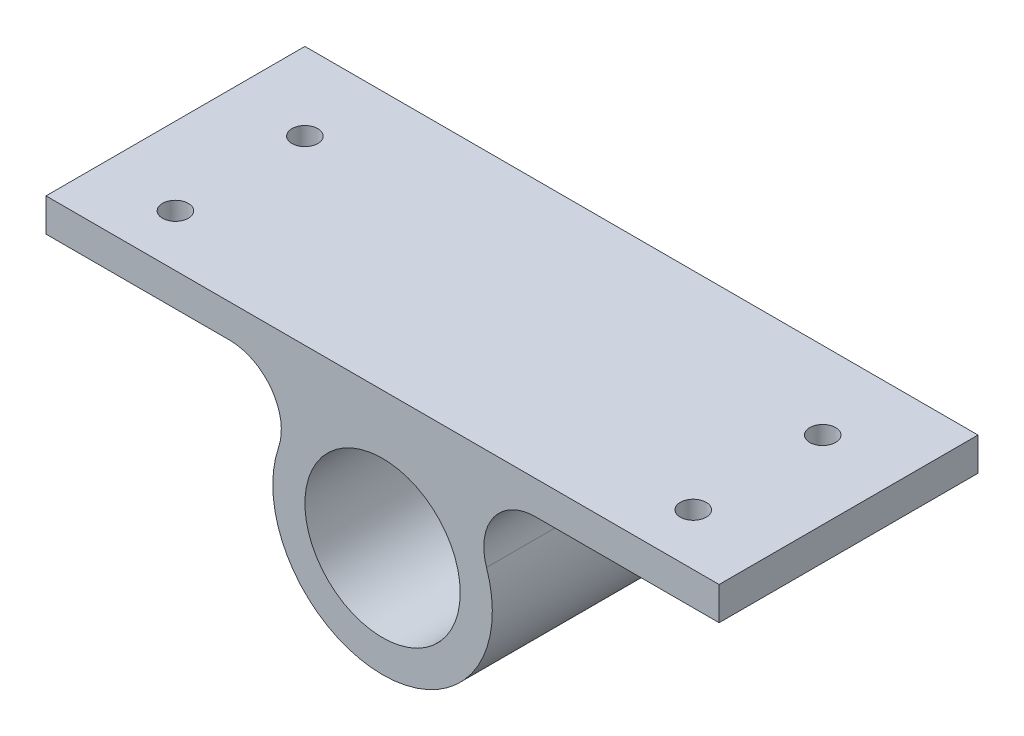
ISO-10303-21;
HEADER;
FILE_DESCRIPTION(('STEP AP214'),'2;1');
FILE_NAME('part.step','',(''),(''),'','','');
FILE_SCHEMA(('AUTOMOTIVE_DESIGN { 1 0 10303 214 1 1 1 1 }'));
ENDSEC;
DATA;
#1=APPLICATION_CONTEXT('core data for automotive mechanical design processes');
#2=APPLICATION_PROTOCOL_DEFINITION('international standard','automotive_design',2000,#1);
#3=PRODUCT_CONTEXT('',#1,'mechanical');
#4=PRODUCT('Part','Part','',(#3));
#5=PRODUCT_RELATED_PRODUCT_CATEGORY('part','',(#4));
#6=PRODUCT_DEFINITION_FORMATION('','',#4);
#7=PRODUCT_DEFINITION_CONTEXT('part definition',#1,'design');
#8=PRODUCT_DEFINITION('design','',#6,#7);
#9=PRODUCT_DEFINITION_SHAPE('','',#8);
#10=(LENGTH_UNIT() NAMED_UNIT(*) SI_UNIT(.MILLI.,.METRE.));
#11=(NAMED_UNIT(*) PLANE_ANGLE_UNIT() SI_UNIT($,.RADIAN.));
#12=(NAMED_UNIT(*) SI_UNIT($,.STERADIAN.) SOLID_ANGLE_UNIT());
#13=UNCERTAINTY_MEASURE_WITH_UNIT(LENGTH_MEASURE(1.E-05),#10,'distance_accuracy_value','');
#14=(GEOMETRIC_REPRESENTATION_CONTEXT(3) GLOBAL_UNCERTAINTY_ASSIGNED_CONTEXT((#13)) GLOBAL_UNIT_ASSIGNED_CONTEXT((#10,
#11,#12)) REPRESENTATION_CONTEXT('',''));
#15=CARTESIAN_POINT('',(0.,0.,0.));
#16=DIRECTION('',(0.,0.,1.));
#17=DIRECTION('',(1.,0.,0.));
#18=AXIS2_PLACEMENT_3D('',#15,#16,#17);
#19=CARTESIAN_POINT('',(0.,-119.,125.));
#20=DIRECTION('',(0.,0.,1.));
#21=DIRECTION('',(1.,0.,0.));
#22=AXIS2_PLACEMENT_3D('',#19,#20,#21);
#23=PLANE('',#22);
#24=CARTESIAN_POINT('',(0.,-13.,125.));
#25=DIRECTION('',(0.,0.,1.));
#26=DIRECTION('',(1.,0.,0.));
#27=AXIS2_PLACEMENT_3D('',#24,#25,#26);
#28=CIRCLE('',#27,75.);
#29=CARTESIAN_POINT('',(75.,-13.,125.));
#30=VERTEX_POINT('',#29);
#31=EDGE_CURVE('E187',#30,#30,#28,.T.);
#32=ORIENTED_EDGE('',*,*,#31,.F.);
#33=EDGE_LOOP('',(#32));
#34=FACE_BOUND('',#33,.T.);
#35=DIRECTION('',(1.,0.,0.));
#36=VECTOR('',#35,1.);
#37=CARTESIAN_POINT('',(0.,87.,125.));
#38=LINE('',#37,#36);
#39=CARTESIAN_POINT('',(-325.,87.,125.));
#40=VERTEX_POINT('',#39);
#41=CARTESIAN_POINT('',(-147.770091696527,87.,125.));
#42=VERTEX_POINT('',#41);
#43=EDGE_CURVE('E221',#40,#42,#38,.T.);
#44=ORIENTED_EDGE('',*,*,#43,.T.);
#45=CARTESIAN_POINT('',(-147.770091696527,37.,125.));
#46=DIRECTION('',(0.,0.,1.));
#47=DIRECTION('',(1.,0.,0.));
#48=AXIS2_PLACEMENT_3D('',#45,#46,#47);
#49=CIRCLE('',#48,50.);
#50=CARTESIAN_POINT('',(-100.407882819435,20.974358974359,125.));
#51=VERTEX_POINT('',#50);
#52=EDGE_CURVE('E196',#42,#51,#49,.F.);
#53=ORIENTED_EDGE('',*,*,#52,.T.);
#54=CARTESIAN_POINT('',(0.,-13.,125.));
#55=DIRECTION('',(0.,0.,1.));
#56=DIRECTION('',(1.,0.,0.));
#57=AXIS2_PLACEMENT_3D('',#54,#55,#56);
#58=CIRCLE('',#57,106.);
#59=CARTESIAN_POINT('',(100.407882819435,20.974358974359,125.));
#60=VERTEX_POINT('',#59);
#61=EDGE_CURVE('E219',#51,#60,#58,.T.);
#62=ORIENTED_EDGE('',*,*,#61,.T.);
#63=CARTESIAN_POINT('',(147.770091696527,37.,125.));
#64=DIRECTION('',(0.,0.,1.));
#65=DIRECTION('',(1.,0.,0.));
#66=AXIS2_PLACEMENT_3D('',#63,#64,#65);
#67=CIRCLE('',#66,50.);
#68=CARTESIAN_POINT('',(147.770091696527,87.,125.));
#69=VERTEX_POINT('',#68);
#70=EDGE_CURVE('E95',#60,#69,#67,.F.);
#71=ORIENTED_EDGE('',*,*,#70,.T.);
#72=DIRECTION('',(1.,0.,0.));
#73=VECTOR('',#72,1.);
#74=CARTESIAN_POINT('',(0.,87.,125.));
#75=LINE('',#74,#73);
#76=CARTESIAN_POINT('',(325.,87.,125.));
#77=VERTEX_POINT('',#76);
#78=EDGE_CURVE('E147',#69,#77,#75,.T.);
#79=ORIENTED_EDGE('',*,*,#78,.T.);
#80=DIRECTION('',(0.,1.,0.));
#81=VECTOR('',#80,1.);
#82=CARTESIAN_POINT('',(325.,-119.,125.));
#83=LINE('',#82,#81);
#84=CARTESIAN_POINT('',(325.,119.,125.));
#85=VERTEX_POINT('',#84);
#86=EDGE_CURVE('E152',#77,#85,#83,.T.);
#87=ORIENTED_EDGE('',*,*,#86,.T.);
#88=DIRECTION('',(1.,0.,0.));
#89=VECTOR('',#88,1.);
#90=CARTESIAN_POINT('',(0.,119.,125.));
#91=LINE('',#90,#89);
#92=CARTESIAN_POINT('',(-325.,119.,125.));
#93=VERTEX_POINT('',#92);
#94=EDGE_CURVE('E246',#93,#85,#91,.T.);
#95=ORIENTED_EDGE('',*,*,#94,.F.);
#96=DIRECTION('',(0.,1.,0.));
#97=VECTOR('',#96,1.);
#98=CARTESIAN_POINT('',(-325.,-119.,125.));
#99=LINE('',#98,#97);
#100=EDGE_CURVE('E164',#40,#93,#99,.T.);
#101=ORIENTED_EDGE('',*,*,#100,.F.);
#102=EDGE_LOOP('',(#44,#53,#62,#71,#79,#87,#95,#101));
#103=FACE_BOUND('',#102,.T.);
#104=ADVANCED_FACE('F87',(#34,#103),#23,.T.);
#105=CARTESIAN_POINT('',(0.,-119.,-125.));
#106=DIRECTION('',(0.,0.,1.));
#107=DIRECTION('',(1.,0.,0.));
#108=AXIS2_PLACEMENT_3D('',#105,#106,#107);
#109=PLANE('',#108);
#110=CARTESIAN_POINT('',(0.,-13.,-125.));
#111=DIRECTION('',(0.,0.,1.));
#112=DIRECTION('',(1.,0.,0.));
#113=AXIS2_PLACEMENT_3D('',#110,#111,#112);
#114=CIRCLE('',#113,75.);
#115=CARTESIAN_POINT('',(75.,-13.,-125.));
#116=VERTEX_POINT('',#115);
#117=EDGE_CURVE('E155',#116,#116,#114,.T.);
#118=ORIENTED_EDGE('',*,*,#117,.T.);
#119=EDGE_LOOP('',(#118));
#120=FACE_BOUND('',#119,.T.);
#121=DIRECTION('',(1.,0.,0.));
#122=VECTOR('',#121,1.);
#123=CARTESIAN_POINT('',(0.,87.,-125.));
#124=LINE('',#123,#122);
#125=CARTESIAN_POINT('',(147.770091696527,87.,-125.));
#126=VERTEX_POINT('',#125);
#127=CARTESIAN_POINT('',(325.,87.,-125.));
#128=VERTEX_POINT('',#127);
#129=EDGE_CURVE('E160',#126,#128,#124,.T.);
#130=ORIENTED_EDGE('',*,*,#129,.F.);
#131=CARTESIAN_POINT('',(147.770091696527,37.,-125.));
#132=DIRECTION('',(0.,0.,1.));
#133=DIRECTION('',(1.,0.,0.));
#134=AXIS2_PLACEMENT_3D('',#131,#132,#133);
#135=CIRCLE('',#134,50.);
#136=CARTESIAN_POINT('',(100.407882819435,20.974358974359,-125.));
#137=VERTEX_POINT('',#136);
#138=EDGE_CURVE('E12',#126,#137,#135,.T.);
#139=ORIENTED_EDGE('',*,*,#138,.T.);
#140=CARTESIAN_POINT('',(0.,-13.,-125.));
#141=DIRECTION('',(0.,0.,1.));
#142=DIRECTION('',(1.,0.,0.));
#143=AXIS2_PLACEMENT_3D('',#140,#141,#142);
#144=CIRCLE('',#143,106.);
#145=CARTESIAN_POINT('',(-100.407882819435,20.974358974359,-125.));
#146=VERTEX_POINT('',#145);
#147=EDGE_CURVE('E183',#146,#137,#144,.T.);
#148=ORIENTED_EDGE('',*,*,#147,.F.);
#149=CARTESIAN_POINT('',(-147.770091696527,37.,-125.));
#150=DIRECTION('',(0.,0.,1.));
#151=DIRECTION('',(1.,0.,0.));
#152=AXIS2_PLACEMENT_3D('',#149,#150,#151);
#153=CIRCLE('',#152,50.);
#154=CARTESIAN_POINT('',(-147.770091696527,87.,-125.));
#155=VERTEX_POINT('',#154);
#156=EDGE_CURVE('E198',#146,#155,#153,.T.);
#157=ORIENTED_EDGE('',*,*,#156,.T.);
#158=DIRECTION('',(1.,0.,0.));
#159=VECTOR('',#158,1.);
#160=CARTESIAN_POINT('',(0.,87.,-125.));
#161=LINE('',#160,#159);
#162=CARTESIAN_POINT('',(-325.,87.,-125.));
#163=VERTEX_POINT('',#162);
#164=EDGE_CURVE('E205',#163,#155,#161,.T.);
#165=ORIENTED_EDGE('',*,*,#164,.F.);
#166=DIRECTION('',(0.,1.,0.));
#167=VECTOR('',#166,1.);
#168=CARTESIAN_POINT('',(-325.,-119.,-125.));
#169=LINE('',#168,#167);
#170=CARTESIAN_POINT('',(-325.,119.,-125.));
#171=VERTEX_POINT('',#170);
#172=EDGE_CURVE('E173',#163,#171,#169,.T.);
#173=ORIENTED_EDGE('',*,*,#172,.T.);
#174=DIRECTION('',(1.,0.,0.));
#175=VECTOR('',#174,1.);
#176=CARTESIAN_POINT('',(0.,119.,-125.));
#177=LINE('',#176,#175);
#178=CARTESIAN_POINT('',(325.,119.,-125.));
#179=VERTEX_POINT('',#178);
#180=EDGE_CURVE('E176',#171,#179,#177,.T.);
#181=ORIENTED_EDGE('',*,*,#180,.T.);
#182=DIRECTION('',(0.,1.,0.));
#183=VECTOR('',#182,1.);
#184=CARTESIAN_POINT('',(325.,-119.,-125.));
#185=LINE('',#184,#183);
#186=EDGE_CURVE('E170',#128,#179,#185,.T.);
#187=ORIENTED_EDGE('',*,*,#186,.F.);
#188=EDGE_LOOP('',(#130,#139,#148,#157,#165,#173,#181,#187));
#189=FACE_BOUND('',#188,.T.);
#190=ADVANCED_FACE('F204',(#120,#189),#109,.F.);
#191=CARTESIAN_POINT('',(250.,-119.,-50.));
#192=DIRECTION('',(0.,1.,0.));
#193=DIRECTION('',(0.,0.,1.));
#194=AXIS2_PLACEMENT_3D('',#191,#192,#193);
#195=CYLINDRICAL_SURFACE('',#194,12.5);
#196=CARTESIAN_POINT('',(250.,119.,-50.));
#197=DIRECTION('',(0.,1.,0.));
#198=DIRECTION('',(0.,0.,1.));
#199=AXIS2_PLACEMENT_3D('',#196,#197,#198);
#200=CIRCLE('',#199,12.5);
#201=CARTESIAN_POINT('',(250.,119.,-37.5));
#202=VERTEX_POINT('',#201);
#203=EDGE_CURVE('E240',#202,#202,#200,.T.);
#204=ORIENTED_EDGE('',*,*,#203,.T.);
#205=EDGE_LOOP('',(#204));
#206=FACE_BOUND('',#205,.T.);
#207=CARTESIAN_POINT('',(250.,87.,-50.));
#208=DIRECTION('',(0.,-1.,0.));
#209=DIRECTION('',(0.,0.,-1.));
#210=AXIS2_PLACEMENT_3D('',#207,#208,#209);
#211=CIRCLE('',#210,12.5);
#212=CARTESIAN_POINT('',(250.,87.,-62.5));
#213=VERTEX_POINT('',#212);
#214=EDGE_CURVE('E227',#213,#213,#211,.F.);
#215=ORIENTED_EDGE('',*,*,#214,.F.);
#216=EDGE_LOOP('',(#215));
#217=FACE_BOUND('',#216,.T.);
#218=ADVANCED_FACE('F277',(#206,#217),#195,.F.);
#219=CARTESIAN_POINT('',(250.000000000001,-119.,75.));
#220=DIRECTION('',(0.,1.,0.));
#221=DIRECTION('',(0.,0.,1.));
#222=AXIS2_PLACEMENT_3D('',#219,#220,#221);
#223=CYLINDRICAL_SURFACE('',#222,12.5);
#224=CARTESIAN_POINT('',(250.000000000001,119.,75.));
#225=DIRECTION('',(0.,1.,0.));
#226=DIRECTION('',(0.,0.,1.));
#227=AXIS2_PLACEMENT_3D('',#224,#225,#226);
#228=CIRCLE('',#227,12.5);
#229=CARTESIAN_POINT('',(250.000000000001,119.,87.5));
#230=VERTEX_POINT('',#229);
#231=EDGE_CURVE('E237',#230,#230,#228,.T.);
#232=ORIENTED_EDGE('',*,*,#231,.T.);
#233=EDGE_LOOP('',(#232));
#234=FACE_BOUND('',#233,.T.);
#235=CARTESIAN_POINT('',(250.000000000001,87.,75.));
#236=DIRECTION('',(0.,-1.,0.));
#237=DIRECTION('',(0.,0.,-1.));
#238=AXIS2_PLACEMENT_3D('',#235,#236,#237);
#239=CIRCLE('',#238,12.5);
#240=CARTESIAN_POINT('',(250.000000000001,87.,62.5));
#241=VERTEX_POINT('',#240);
#242=EDGE_CURVE('E154',#241,#241,#239,.F.);
#243=ORIENTED_EDGE('',*,*,#242,.F.);
#244=EDGE_LOOP('',(#243));
#245=FACE_BOUND('',#244,.T.);
#246=ADVANCED_FACE('F267',(#234,#245),#223,.F.);
#247=CARTESIAN_POINT('',(325.,-119.,0.));
#248=DIRECTION('',(1.,0.,0.));
#249=DIRECTION('',(0.,0.,-1.));
#250=AXIS2_PLACEMENT_3D('',#247,#248,#249);
#251=PLANE('',#250);
#252=ORIENTED_EDGE('',*,*,#86,.F.);
#253=DIRECTION('',(0.,0.,-1.));
#254=VECTOR('',#253,1.);
#255=CARTESIAN_POINT('',(325.,87.,0.));
#256=LINE('',#255,#254);
#257=EDGE_CURVE('E158',#77,#128,#256,.T.);
#258=ORIENTED_EDGE('',*,*,#257,.T.);
#259=ORIENTED_EDGE('',*,*,#186,.T.);
#260=DIRECTION('',(0.,0.,-1.));
#261=VECTOR('',#260,1.);
#262=CARTESIAN_POINT('',(325.,119.,0.));
#263=LINE('',#262,#261);
#264=EDGE_CURVE('E168',#85,#179,#263,.T.);
#265=ORIENTED_EDGE('',*,*,#264,.F.);
#266=EDGE_LOOP('',(#252,#258,#259,#265));
#267=FACE_BOUND('',#266,.T.);
#268=ADVANCED_FACE('F166',(#267),#251,.T.);
#269=CARTESIAN_POINT('',(-325.,-119.,0.));
#270=DIRECTION('',(1.,0.,0.));
#271=DIRECTION('',(0.,0.,-1.));
#272=AXIS2_PLACEMENT_3D('',#269,#270,#271);
#273=PLANE('',#272);
#274=DIRECTION('',(0.,0.,1.));
#275=VECTOR('',#274,1.);
#276=CARTESIAN_POINT('',(-325.,87.,-142.));
#277=LINE('',#276,#275);
#278=EDGE_CURVE('E214',#163,#40,#277,.T.);
#279=ORIENTED_EDGE('',*,*,#278,.T.);
#280=ORIENTED_EDGE('',*,*,#100,.T.);
#281=DIRECTION('',(0.,0.,-1.));
#282=VECTOR('',#281,1.);
#283=CARTESIAN_POINT('',(-325.,119.,0.));
#284=LINE('',#283,#282);
#285=EDGE_CURVE('E171',#93,#171,#284,.T.);
#286=ORIENTED_EDGE('',*,*,#285,.T.);
#287=ORIENTED_EDGE('',*,*,#172,.F.);
#288=EDGE_LOOP('',(#279,#280,#286,#287));
#289=FACE_BOUND('',#288,.T.);
#290=ADVANCED_FACE('F256',(#289),#273,.F.);
#291=CARTESIAN_POINT('',(-250.,-119.,-50.));
#292=DIRECTION('',(0.,1.,0.));
#293=DIRECTION('',(0.,0.,1.));
#294=AXIS2_PLACEMENT_3D('',#291,#292,#293);
#295=CYLINDRICAL_SURFACE('',#294,12.5);
#296=CARTESIAN_POINT('',(-250.,119.,-50.));
#297=DIRECTION('',(0.,1.,0.));
#298=DIRECTION('',(0.,0.,1.));
#299=AXIS2_PLACEMENT_3D('',#296,#297,#298);
#300=CIRCLE('',#299,12.5);
#301=CARTESIAN_POINT('',(-250.,119.,-37.5));
#302=VERTEX_POINT('',#301);
#303=EDGE_CURVE('E243',#302,#302,#300,.T.);
#304=ORIENTED_EDGE('',*,*,#303,.T.);
#305=EDGE_LOOP('',(#304));
#306=FACE_BOUND('',#305,.T.);
#307=CARTESIAN_POINT('',(-250.,87.,-50.));
#308=DIRECTION('',(0.,-1.,0.));
#309=DIRECTION('',(0.,0.,-1.));
#310=AXIS2_PLACEMENT_3D('',#307,#308,#309);
#311=CIRCLE('',#310,12.5);
#312=CARTESIAN_POINT('',(-250.,87.,-62.5));
#313=VERTEX_POINT('',#312);
#314=EDGE_CURVE('E182',#313,#313,#311,.F.);
#315=ORIENTED_EDGE('',*,*,#314,.F.);
#316=EDGE_LOOP('',(#315));
#317=FACE_BOUND('',#316,.T.);
#318=ADVANCED_FACE('F258',(#306,#317),#295,.F.);
#319=CARTESIAN_POINT('',(-249.999999999999,-119.,75.));
#320=DIRECTION('',(0.,1.,0.));
#321=DIRECTION('',(0.,0.,1.));
#322=AXIS2_PLACEMENT_3D('',#319,#320,#321);
#323=CYLINDRICAL_SURFACE('',#322,12.5);
#324=CARTESIAN_POINT('',(-249.999999999999,119.,75.));
#325=DIRECTION('',(0.,1.,0.));
#326=DIRECTION('',(0.,0.,1.));
#327=AXIS2_PLACEMENT_3D('',#324,#325,#326);
#328=CIRCLE('',#327,12.5);
#329=CARTESIAN_POINT('',(-249.999999999999,119.,87.5));
#330=VERTEX_POINT('',#329);
#331=EDGE_CURVE('E215',#330,#330,#328,.T.);
#332=ORIENTED_EDGE('',*,*,#331,.T.);
#333=EDGE_LOOP('',(#332));
#334=FACE_BOUND('',#333,.T.);
#335=CARTESIAN_POINT('',(-249.999999999999,87.,75.));
#336=DIRECTION('',(0.,-1.,0.));
#337=DIRECTION('',(0.,0.,-1.));
#338=AXIS2_PLACEMENT_3D('',#335,#336,#337);
#339=CIRCLE('',#338,12.5);
#340=CARTESIAN_POINT('',(-249.999999999999,87.,62.5));
#341=VERTEX_POINT('',#340);
#342=EDGE_CURVE('E180',#341,#341,#339,.F.);
#343=ORIENTED_EDGE('',*,*,#342,.F.);
#344=EDGE_LOOP('',(#343));
#345=FACE_BOUND('',#344,.T.);
#346=ADVANCED_FACE('F264',(#334,#345),#323,.F.);
#347=CARTESIAN_POINT('',(0.,119.,0.));
#348=DIRECTION('',(0.,1.,0.));
#349=DIRECTION('',(0.,0.,1.));
#350=AXIS2_PLACEMENT_3D('',#347,#348,#349);
#351=PLANE('',#350);
#352=ORIENTED_EDGE('',*,*,#331,.F.);
#353=EDGE_LOOP('',(#352));
#354=FACE_BOUND('',#353,.T.);
#355=ORIENTED_EDGE('',*,*,#231,.F.);
#356=EDGE_LOOP('',(#355));
#357=FACE_BOUND('',#356,.T.);
#358=ORIENTED_EDGE('',*,*,#203,.F.);
#359=EDGE_LOOP('',(#358));
#360=FACE_BOUND('',#359,.T.);
#361=ORIENTED_EDGE('',*,*,#303,.F.);
#362=EDGE_LOOP('',(#361));
#363=FACE_BOUND('',#362,.T.);
#364=ORIENTED_EDGE('',*,*,#94,.T.);
#365=ORIENTED_EDGE('',*,*,#264,.T.);
#366=ORIENTED_EDGE('',*,*,#180,.F.);
#367=ORIENTED_EDGE('',*,*,#285,.F.);
#368=EDGE_LOOP('',(#364,#365,#366,#367));
#369=FACE_BOUND('',#368,.T.);
#370=ADVANCED_FACE('F255',(#354,#357,#360,#363,#369),#351,.T.);
#371=CARTESIAN_POINT('',(0.,87.,-142.));
#372=DIRECTION('',(0.,-1.,0.));
#373=DIRECTION('',(0.,0.,-1.));
#374=AXIS2_PLACEMENT_3D('',#371,#372,#373);
#375=PLANE('',#374);
#376=ORIENTED_EDGE('',*,*,#314,.T.);
#377=EDGE_LOOP('',(#376));
#378=FACE_BOUND('',#377,.T.);
#379=ORIENTED_EDGE('',*,*,#342,.T.);
#380=EDGE_LOOP('',(#379));
#381=FACE_BOUND('',#380,.T.);
#382=ORIENTED_EDGE('',*,*,#164,.T.);
#383=DIRECTION('',(0.,0.,-1.));
#384=VECTOR('',#383,1.);
#385=CARTESIAN_POINT('',(-147.770091696527,87.,125.));
#386=LINE('',#385,#384);
#387=EDGE_CURVE('E163',#155,#42,#386,.F.);
#388=ORIENTED_EDGE('',*,*,#387,.T.);
#389=ORIENTED_EDGE('',*,*,#43,.F.);
#390=ORIENTED_EDGE('',*,*,#278,.F.);
#391=EDGE_LOOP('',(#382,#388,#389,#390));
#392=FACE_BOUND('',#391,.T.);
#393=ADVANCED_FACE('F212',(#378,#381,#392),#375,.T.);
#394=CARTESIAN_POINT('',(0.,-13.,-142.));
#395=DIRECTION('',(0.,0.,1.));
#396=DIRECTION('',(1.,0.,0.));
#397=AXIS2_PLACEMENT_3D('',#394,#395,#396);
#398=CYLINDRICAL_SURFACE('',#397,106.);
#399=ORIENTED_EDGE('',*,*,#61,.F.);
#400=DIRECTION('',(0.,0.,1.));
#401=VECTOR('',#400,1.);
#402=CARTESIAN_POINT('',(-100.407882819435,20.974358974359,-142.));
#403=LINE('',#402,#401);
#404=EDGE_CURVE('E193',#51,#146,#403,.F.);
#405=ORIENTED_EDGE('',*,*,#404,.T.);
#406=ORIENTED_EDGE('',*,*,#147,.T.);
#407=DIRECTION('',(0.,0.,1.));
#408=VECTOR('',#407,1.);
#409=CARTESIAN_POINT('',(100.407882819435,20.974358974359,-142.));
#410=LINE('',#409,#408);
#411=EDGE_CURVE('E190',#137,#60,#410,.T.);
#412=ORIENTED_EDGE('',*,*,#411,.T.);
#413=EDGE_LOOP('',(#399,#405,#406,#412));
#414=FACE_BOUND('',#413,.T.);
#415=ADVANCED_FACE('F223',(#414),#398,.T.);
#416=CARTESIAN_POINT('',(0.,87.,-142.));
#417=DIRECTION('',(0.,-1.,0.));
#418=DIRECTION('',(0.,0.,-1.));
#419=AXIS2_PLACEMENT_3D('',#416,#417,#418);
#420=PLANE('',#419);
#421=ORIENTED_EDGE('',*,*,#214,.T.);
#422=EDGE_LOOP('',(#421));
#423=FACE_BOUND('',#422,.T.);
#424=ORIENTED_EDGE('',*,*,#242,.T.);
#425=EDGE_LOOP('',(#424));
#426=FACE_BOUND('',#425,.T.);
#427=ORIENTED_EDGE('',*,*,#78,.F.);
#428=DIRECTION('',(0.,0.,-1.));
#429=VECTOR('',#428,1.);
#430=CARTESIAN_POINT('',(147.770091696527,87.,-125.));
#431=LINE('',#430,#429);
#432=EDGE_CURVE('E108',#69,#126,#431,.T.);
#433=ORIENTED_EDGE('',*,*,#432,.T.);
#434=ORIENTED_EDGE('',*,*,#129,.T.);
#435=ORIENTED_EDGE('',*,*,#257,.F.);
#436=EDGE_LOOP('',(#427,#433,#434,#435));
#437=FACE_BOUND('',#436,.T.);
#438=ADVANCED_FACE('F159',(#423,#426,#437),#420,.T.);
#439=CARTESIAN_POINT('',(0.,-13.,-142.));
#440=DIRECTION('',(0.,0.,1.));
#441=DIRECTION('',(1.,0.,0.));
#442=AXIS2_PLACEMENT_3D('',#439,#440,#441);
#443=CYLINDRICAL_SURFACE('',#442,75.);
#444=ORIENTED_EDGE('',*,*,#31,.T.);
#445=EDGE_LOOP('',(#444));
#446=FACE_BOUND('',#445,.T.);
#447=ORIENTED_EDGE('',*,*,#117,.F.);
#448=EDGE_LOOP('',(#447));
#449=FACE_BOUND('',#448,.T.);
#450=ADVANCED_FACE('F290',(#446,#449),#443,.F.);
#451=CARTESIAN_POINT('',(-147.770091696527,37.,-142.));
#452=DIRECTION('',(0.,0.,1.));
#453=DIRECTION('',(1.,0.,0.));
#454=AXIS2_PLACEMENT_3D('',#451,#452,#453);
#455=CYLINDRICAL_SURFACE('',#454,50.);
#456=ORIENTED_EDGE('',*,*,#156,.F.);
#457=ORIENTED_EDGE('',*,*,#404,.F.);
#458=ORIENTED_EDGE('',*,*,#52,.F.);
#459=ORIENTED_EDGE('',*,*,#387,.F.);
#460=EDGE_LOOP('',(#456,#457,#458,#459));
#461=FACE_BOUND('',#460,.T.);
#462=ADVANCED_FACE('F217',(#461),#455,.F.);
#463=CARTESIAN_POINT('',(147.770091696527,37.,-142.));
#464=DIRECTION('',(0.,0.,1.));
#465=DIRECTION('',(1.,0.,0.));
#466=AXIS2_PLACEMENT_3D('',#463,#464,#465);
#467=CYLINDRICAL_SURFACE('',#466,50.);
#468=ORIENTED_EDGE('',*,*,#138,.F.);
#469=ORIENTED_EDGE('',*,*,#432,.F.);
#470=ORIENTED_EDGE('',*,*,#70,.F.);
#471=ORIENTED_EDGE('',*,*,#411,.F.);
#472=EDGE_LOOP('',(#468,#469,#470,#471));
#473=FACE_BOUND('',#472,.T.);
#474=ADVANCED_FACE('F89',(#473),#467,.F.);
#475=CLOSED_SHELL('',(#104,#190,#218,#246,#268,#290,#318,#346,#370,#393,#415,#438,#450,#462,#474));
#476=MANIFOLD_SOLID_BREP('B2',#475);
#477=ADVANCED_BREP_SHAPE_REPRESENTATION('',(#18,#476),#14);
#478=SHAPE_DEFINITION_REPRESENTATION(#9,#477);
ENDSEC;
END-ISO-10303-21;
